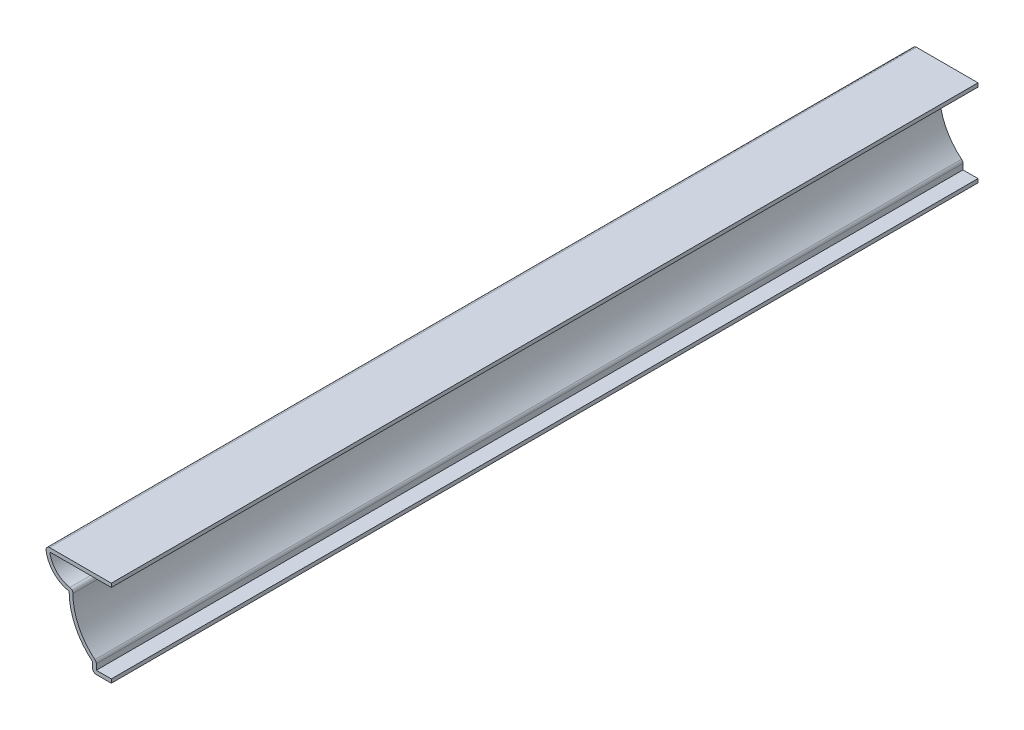
ISO-10303-21;
HEADER;
FILE_DESCRIPTION(('STEP AP214'),'2;1');
FILE_NAME('part.step','',(''),(''),'','','');
FILE_SCHEMA(('AUTOMOTIVE_DESIGN { 1 0 10303 214 1 1 1 1 }'));
ENDSEC;
DATA;
#1=APPLICATION_CONTEXT('core data for automotive mechanical design processes');
#2=APPLICATION_PROTOCOL_DEFINITION('international standard','automotive_design',2000,#1);
#3=PRODUCT_CONTEXT('',#1,'mechanical');
#4=PRODUCT('Part','Part','',(#3));
#5=PRODUCT_RELATED_PRODUCT_CATEGORY('part','',(#4));
#6=PRODUCT_DEFINITION_FORMATION('','',#4);
#7=PRODUCT_DEFINITION_CONTEXT('part definition',#1,'design');
#8=PRODUCT_DEFINITION('design','',#6,#7);
#9=PRODUCT_DEFINITION_SHAPE('','',#8);
#10=(LENGTH_UNIT() NAMED_UNIT(*) SI_UNIT(.MILLI.,.METRE.));
#11=(NAMED_UNIT(*) PLANE_ANGLE_UNIT() SI_UNIT($,.RADIAN.));
#12=(NAMED_UNIT(*) SI_UNIT($,.STERADIAN.) SOLID_ANGLE_UNIT());
#13=UNCERTAINTY_MEASURE_WITH_UNIT(LENGTH_MEASURE(1.E-05),#10,'distance_accuracy_value','');
#14=(GEOMETRIC_REPRESENTATION_CONTEXT(3) GLOBAL_UNCERTAINTY_ASSIGNED_CONTEXT((#13)) GLOBAL_UNIT_ASSIGNED_CONTEXT((#10,
#11,#12)) REPRESENTATION_CONTEXT('',''));
#15=CARTESIAN_POINT('',(0.,0.,0.));
#16=DIRECTION('',(0.,0.,1.));
#17=DIRECTION('',(1.,0.,0.));
#18=AXIS2_PLACEMENT_3D('',#15,#16,#17);
#19=CARTESIAN_POINT('',(-22.225,28.09875,-293.6875));
#20=DIRECTION('',(0.,-1.,0.));
#21=DIRECTION('',(0.,0.,-1.));
#22=AXIS2_PLACEMENT_3D('',#19,#20,#21);
#23=PLANE('',#22);
#24=DIRECTION('',(1.,0.,0.));
#25=VECTOR('',#24,1.);
#26=CARTESIAN_POINT('',(-22.225,28.09875,0.));
#27=LINE('',#26,#25);
#28=CARTESIAN_POINT('',(-20.8585986798679,28.09875,0.));
#29=VERTEX_POINT('',#28);
#30=CARTESIAN_POINT('',(0.,28.09875,0.));
#31=VERTEX_POINT('',#30);
#32=EDGE_CURVE('E203',#29,#31,#27,.T.);
#33=ORIENTED_EDGE('',*,*,#32,.F.);
#34=DIRECTION('',(0.,0.,1.));
#35=VECTOR('',#34,1.);
#36=CARTESIAN_POINT('',(-20.8585986798679,28.09875,-293.6875));
#37=LINE('',#36,#35);
#38=CARTESIAN_POINT('',(-20.8585986798679,28.09875,-293.6875));
#39=VERTEX_POINT('',#38);
#40=EDGE_CURVE('E176',#39,#29,#37,.T.);
#41=ORIENTED_EDGE('',*,*,#40,.F.);
#42=DIRECTION('',(1.,0.,0.));
#43=VECTOR('',#42,1.);
#44=CARTESIAN_POINT('',(-22.225,28.09875,-293.6875));
#45=LINE('',#44,#43);
#46=CARTESIAN_POINT('',(0.,28.09875,-293.6875));
#47=VERTEX_POINT('',#46);
#48=EDGE_CURVE('E157',#39,#47,#45,.T.);
#49=ORIENTED_EDGE('',*,*,#48,.T.);
#50=DIRECTION('',(0.,0.,1.));
#51=VECTOR('',#50,1.);
#52=CARTESIAN_POINT('',(0.,28.09875,-293.6875));
#53=LINE('',#52,#51);
#54=EDGE_CURVE('E164',#47,#31,#53,.T.);
#55=ORIENTED_EDGE('',*,*,#54,.T.);
#56=EDGE_LOOP('',(#33,#41,#49,#55));
#57=FACE_BOUND('',#56,.T.);
#58=ADVANCED_FACE('F39',(#57),#23,.T.);
#59=CARTESIAN_POINT('',(-12.54125,29.36875,-293.6875));
#60=DIRECTION('',(0.,0.,1.));
#61=DIRECTION('',(1.,0.,0.));
#62=AXIS2_PLACEMENT_3D('',#59,#60,#61);
#63=CYLINDRICAL_SURFACE('',#62,8.41375);
#64=CARTESIAN_POINT('',(-12.54125,29.36875,0.));
#65=DIRECTION('',(0.,0.,1.));
#66=DIRECTION('',(1.,0.,0.));
#67=AXIS2_PLACEMENT_3D('',#64,#65,#66);
#68=CIRCLE('',#67,8.41375);
#69=CARTESIAN_POINT('',(-14.0584836065574,21.0929303278688,0.));
#70=VERTEX_POINT('',#69);
#71=EDGE_CURVE('E177',#70,#29,#68,.F.);
#72=ORIENTED_EDGE('',*,*,#71,.F.);
#73=DIRECTION('',(0.,0.,1.));
#74=VECTOR('',#73,1.);
#75=CARTESIAN_POINT('',(-14.0584836065574,21.0929303278688,-293.6875));
#76=LINE('',#75,#74);
#77=CARTESIAN_POINT('',(-14.0584836065574,21.0929303278688,-293.6875));
#78=VERTEX_POINT('',#77);
#79=EDGE_CURVE('E270',#70,#78,#76,.F.);
#80=ORIENTED_EDGE('',*,*,#79,.T.);
#81=CARTESIAN_POINT('',(-12.54125,29.36875,-293.6875));
#82=DIRECTION('',(0.,0.,1.));
#83=DIRECTION('',(1.,0.,0.));
#84=AXIS2_PLACEMENT_3D('',#81,#82,#83);
#85=CIRCLE('',#84,8.41375);
#86=EDGE_CURVE('E172',#78,#39,#85,.F.);
#87=ORIENTED_EDGE('',*,*,#86,.T.);
#88=ORIENTED_EDGE('',*,*,#40,.T.);
#89=EDGE_LOOP('',(#72,#80,#87,#88));
#90=FACE_BOUND('',#89,.T.);
#91=ADVANCED_FACE('F284',(#90),#63,.F.);
#92=CARTESIAN_POINT('',(7.18343750000002,19.84375,-293.6875));
#93=DIRECTION('',(0.,0.,1.));
#94=DIRECTION('',(1.,0.,0.));
#95=AXIS2_PLACEMENT_3D('',#92,#93,#94);
#96=CYLINDRICAL_SURFACE('',#95,20.2009375);
#97=CARTESIAN_POINT('',(7.18343750000002,19.84375,0.));
#98=DIRECTION('',(0.,0.,1.));
#99=DIRECTION('',(1.,0.,0.));
#100=AXIS2_PLACEMENT_3D('',#97,#98,#99);
#101=CIRCLE('',#100,20.2009375);
#102=CARTESIAN_POINT('',(-5.54950092421442,4.16095194085027,0.));
#103=VERTEX_POINT('',#102);
#104=CARTESIAN_POINT('',(-13.0175,19.84375,0.));
#105=VERTEX_POINT('',#104);
#106=EDGE_CURVE('E179',#103,#105,#101,.F.);
#107=ORIENTED_EDGE('',*,*,#106,.F.);
#108=DIRECTION('',(0.,0.,1.));
#109=VECTOR('',#108,1.);
#110=CARTESIAN_POINT('',(-5.54950092421442,4.16095194085027,-293.6875));
#111=LINE('',#110,#109);
#112=CARTESIAN_POINT('',(-5.54950092421442,4.16095194085027,-293.6875));
#113=VERTEX_POINT('',#112);
#114=EDGE_CURVE('E268',#103,#113,#111,.F.);
#115=ORIENTED_EDGE('',*,*,#114,.T.);
#116=CARTESIAN_POINT('',(7.18343750000002,19.84375,-293.6875));
#117=DIRECTION('',(0.,0.,1.));
#118=DIRECTION('',(1.,0.,0.));
#119=AXIS2_PLACEMENT_3D('',#116,#117,#118);
#120=CIRCLE('',#119,20.2009375);
#121=CARTESIAN_POINT('',(-13.0175,19.84375,-293.6875));
#122=VERTEX_POINT('',#121);
#123=EDGE_CURVE('E199',#113,#122,#120,.F.);
#124=ORIENTED_EDGE('',*,*,#123,.T.);
#125=DIRECTION('',(0.,0.,1.));
#126=VECTOR('',#125,1.);
#127=CARTESIAN_POINT('',(-13.0175,19.84375,-293.6875));
#128=LINE('',#127,#126);
#129=EDGE_CURVE('E265',#122,#105,#128,.T.);
#130=ORIENTED_EDGE('',*,*,#129,.T.);
#131=EDGE_LOOP('',(#107,#115,#124,#130));
#132=FACE_BOUND('',#131,.T.);
#133=ADVANCED_FACE('F292',(#132),#96,.F.);
#134=CARTESIAN_POINT('',(-5.08,0.,-293.6875));
#135=DIRECTION('',(1.,0.,0.));
#136=DIRECTION('',(0.,0.,-1.));
#137=AXIS2_PLACEMENT_3D('',#134,#135,#136);
#138=PLANE('',#137);
#139=DIRECTION('',(0.,1.,0.));
#140=VECTOR('',#139,1.);
#141=CARTESIAN_POINT('',(-5.08,0.,-293.6875));
#142=LINE('',#141,#140);
#143=CARTESIAN_POINT('',(-5.08,1.27,-293.6875));
#144=VERTEX_POINT('',#143);
#145=CARTESIAN_POINT('',(-5.08,3.17499999999999,-293.6875));
#146=VERTEX_POINT('',#145);
#147=EDGE_CURVE('E196',#144,#146,#142,.T.);
#148=ORIENTED_EDGE('',*,*,#147,.T.);
#149=DIRECTION('',(0.,0.,1.));
#150=VECTOR('',#149,1.);
#151=CARTESIAN_POINT('',(-5.08,3.17499999999999,-293.6875));
#152=LINE('',#151,#150);
#153=CARTESIAN_POINT('',(-5.08,3.17499999999999,0.));
#154=VERTEX_POINT('',#153);
#155=EDGE_CURVE('E262',#146,#154,#152,.T.);
#156=ORIENTED_EDGE('',*,*,#155,.T.);
#157=DIRECTION('',(0.,1.,0.));
#158=VECTOR('',#157,1.);
#159=CARTESIAN_POINT('',(-5.08,0.,0.));
#160=LINE('',#159,#158);
#161=CARTESIAN_POINT('',(-5.08,1.27,0.));
#162=VERTEX_POINT('',#161);
#163=EDGE_CURVE('E222',#162,#154,#160,.T.);
#164=ORIENTED_EDGE('',*,*,#163,.F.);
#165=DIRECTION('',(0.,0.,1.));
#166=VECTOR('',#165,1.);
#167=CARTESIAN_POINT('',(-5.08,1.27,-293.6875));
#168=LINE('',#167,#166);
#169=EDGE_CURVE('E229',#144,#162,#168,.T.);
#170=ORIENTED_EDGE('',*,*,#169,.F.);
#171=EDGE_LOOP('',(#148,#156,#164,#170));
#172=FACE_BOUND('',#171,.T.);
#173=ADVANCED_FACE('F300',(#172),#138,.T.);
#174=CARTESIAN_POINT('',(0.,1.27,-293.6875));
#175=DIRECTION('',(0.,1.,0.));
#176=DIRECTION('',(0.,0.,1.));
#177=AXIS2_PLACEMENT_3D('',#174,#175,#176);
#178=PLANE('',#177);
#179=DIRECTION('',(1.,0.,0.));
#180=VECTOR('',#179,1.);
#181=CARTESIAN_POINT('',(0.,1.27,0.));
#182=LINE('',#181,#180);
#183=CARTESIAN_POINT('',(0.,1.27,0.));
#184=VERTEX_POINT('',#183);
#185=EDGE_CURVE('E219',#184,#162,#182,.F.);
#186=ORIENTED_EDGE('',*,*,#185,.F.);
#187=DIRECTION('',(0.,0.,1.));
#188=VECTOR('',#187,1.);
#189=CARTESIAN_POINT('',(0.,1.27,-293.6875));
#190=LINE('',#189,#188);
#191=CARTESIAN_POINT('',(0.,1.27,-293.6875));
#192=VERTEX_POINT('',#191);
#193=EDGE_CURVE('E231',#192,#184,#190,.T.);
#194=ORIENTED_EDGE('',*,*,#193,.F.);
#195=DIRECTION('',(1.,0.,0.));
#196=VECTOR('',#195,1.);
#197=CARTESIAN_POINT('',(0.,1.27,-293.6875));
#198=LINE('',#197,#196);
#199=EDGE_CURVE('E193',#192,#144,#198,.F.);
#200=ORIENTED_EDGE('',*,*,#199,.T.);
#201=ORIENTED_EDGE('',*,*,#169,.T.);
#202=EDGE_LOOP('',(#186,#194,#200,#201));
#203=FACE_BOUND('',#202,.T.);
#204=ADVANCED_FACE('F305',(#203),#178,.T.);
#205=CARTESIAN_POINT('',(0.,1.27,-293.6875));
#206=DIRECTION('',(-1.,0.,0.));
#207=DIRECTION('',(0.,0.,1.));
#208=AXIS2_PLACEMENT_3D('',#205,#206,#207);
#209=PLANE('',#208);
#210=DIRECTION('',(0.,-1.,0.));
#211=VECTOR('',#210,1.);
#212=CARTESIAN_POINT('',(0.,1.27,0.));
#213=LINE('',#212,#211);
#214=CARTESIAN_POINT('',(0.,0.,0.));
#215=VERTEX_POINT('',#214);
#216=EDGE_CURVE('E217',#184,#215,#213,.T.);
#217=ORIENTED_EDGE('',*,*,#216,.T.);
#218=DIRECTION('',(0.,0.,1.));
#219=VECTOR('',#218,1.);
#220=CARTESIAN_POINT('',(0.,0.,-293.6875));
#221=LINE('',#220,#219);
#222=CARTESIAN_POINT('',(0.,0.,-293.6875));
#223=VERTEX_POINT('',#222);
#224=EDGE_CURVE('E233',#223,#215,#221,.T.);
#225=ORIENTED_EDGE('',*,*,#224,.F.);
#226=DIRECTION('',(0.,-1.,0.));
#227=VECTOR('',#226,1.);
#228=CARTESIAN_POINT('',(0.,1.27,-293.6875));
#229=LINE('',#228,#227);
#230=EDGE_CURVE('E191',#192,#223,#229,.T.);
#231=ORIENTED_EDGE('',*,*,#230,.F.);
#232=ORIENTED_EDGE('',*,*,#193,.T.);
#233=EDGE_LOOP('',(#217,#225,#231,#232));
#234=FACE_BOUND('',#233,.T.);
#235=ADVANCED_FACE('F310',(#234),#209,.F.);
#236=CARTESIAN_POINT('',(0.,0.,-293.6875));
#237=DIRECTION('',(0.,1.,0.));
#238=DIRECTION('',(0.,0.,1.));
#239=AXIS2_PLACEMENT_3D('',#236,#237,#238);
#240=PLANE('',#239);
#241=DIRECTION('',(-1.,0.,0.));
#242=VECTOR('',#241,1.);
#243=CARTESIAN_POINT('',(0.,0.,0.));
#244=LINE('',#243,#242);
#245=CARTESIAN_POINT('',(-5.08,0.,0.));
#246=VERTEX_POINT('',#245);
#247=EDGE_CURVE('E214',#215,#246,#244,.T.);
#248=ORIENTED_EDGE('',*,*,#247,.T.);
#249=DIRECTION('',(0.,0.,1.));
#250=VECTOR('',#249,1.);
#251=CARTESIAN_POINT('',(-5.08,0.,-293.6875));
#252=LINE('',#251,#250);
#253=CARTESIAN_POINT('',(-5.08,0.,-293.6875));
#254=VERTEX_POINT('',#253);
#255=EDGE_CURVE('E253',#246,#254,#252,.F.);
#256=ORIENTED_EDGE('',*,*,#255,.T.);
#257=DIRECTION('',(-1.,0.,0.));
#258=VECTOR('',#257,1.);
#259=CARTESIAN_POINT('',(0.,0.,-293.6875));
#260=LINE('',#259,#258);
#261=EDGE_CURVE('E189',#223,#254,#260,.T.);
#262=ORIENTED_EDGE('',*,*,#261,.F.);
#263=ORIENTED_EDGE('',*,*,#224,.T.);
#264=EDGE_LOOP('',(#248,#256,#262,#263));
#265=FACE_BOUND('',#264,.T.);
#266=ADVANCED_FACE('F416',(#265),#240,.F.);
#267=CARTESIAN_POINT('',(-6.35,0.,-293.6875));
#268=DIRECTION('',(1.,0.,0.));
#269=DIRECTION('',(0.,0.,-1.));
#270=AXIS2_PLACEMENT_3D('',#267,#268,#269);
#271=PLANE('',#270);
#272=DIRECTION('',(0.,1.,0.));
#273=VECTOR('',#272,1.);
#274=CARTESIAN_POINT('',(-6.35,0.,-293.6875));
#275=LINE('',#274,#273);
#276=CARTESIAN_POINT('',(-6.35,1.27,-293.6875));
#277=VERTEX_POINT('',#276);
#278=CARTESIAN_POINT('',(-6.35,3.175,-293.6875));
#279=VERTEX_POINT('',#278);
#280=EDGE_CURVE('E187',#277,#279,#275,.T.);
#281=ORIENTED_EDGE('',*,*,#280,.F.);
#282=DIRECTION('',(0.,0.,1.));
#283=VECTOR('',#282,1.);
#284=CARTESIAN_POINT('',(-6.35,1.27,-293.6875));
#285=LINE('',#284,#283);
#286=CARTESIAN_POINT('',(-6.35,1.27,0.));
#287=VERTEX_POINT('',#286);
#288=EDGE_CURVE('E228',#277,#287,#285,.T.);
#289=ORIENTED_EDGE('',*,*,#288,.T.);
#290=DIRECTION('',(0.,1.,0.));
#291=VECTOR('',#290,1.);
#292=CARTESIAN_POINT('',(-6.35,0.,0.));
#293=LINE('',#292,#291);
#294=CARTESIAN_POINT('',(-6.35,3.175,0.));
#295=VERTEX_POINT('',#294);
#296=EDGE_CURVE('E212',#287,#295,#293,.T.);
#297=ORIENTED_EDGE('',*,*,#296,.T.);
#298=DIRECTION('',(0.,0.,1.));
#299=VECTOR('',#298,1.);
#300=CARTESIAN_POINT('',(-6.35,3.175,-293.6875));
#301=LINE('',#300,#299);
#302=EDGE_CURVE('E236',#279,#295,#301,.T.);
#303=ORIENTED_EDGE('',*,*,#302,.F.);
#304=EDGE_LOOP('',(#281,#289,#297,#303));
#305=FACE_BOUND('',#304,.T.);
#306=ADVANCED_FACE('F320',(#305),#271,.F.);
#307=CARTESIAN_POINT('',(7.18343750000002,19.84375,-293.6875));
#308=DIRECTION('',(0.,0.,1.));
#309=DIRECTION('',(1.,0.,0.));
#310=AXIS2_PLACEMENT_3D('',#307,#308,#309);
#311=CYLINDRICAL_SURFACE('',#310,21.4709375);
#312=CARTESIAN_POINT('',(7.18343750000002,19.84375,0.));
#313=DIRECTION('',(0.,0.,-1.));
#314=DIRECTION('',(-1.,0.,0.));
#315=AXIS2_PLACEMENT_3D('',#312,#313,#314);
#316=CIRCLE('',#315,21.4709375);
#317=CARTESIAN_POINT('',(-14.2875,19.84375,0.));
#318=VERTEX_POINT('',#317);
#319=EDGE_CURVE('E210',#295,#318,#316,.T.);
#320=ORIENTED_EDGE('',*,*,#319,.T.);
#321=DIRECTION('',(0.,0.,1.));
#322=VECTOR('',#321,1.);
#323=CARTESIAN_POINT('',(-14.2875,19.84375,-293.6875));
#324=LINE('',#323,#322);
#325=CARTESIAN_POINT('',(-14.2875,19.84375,-293.6875));
#326=VERTEX_POINT('',#325);
#327=EDGE_CURVE('E239',#326,#318,#324,.T.);
#328=ORIENTED_EDGE('',*,*,#327,.F.);
#329=CARTESIAN_POINT('',(7.18343750000002,19.84375,-293.6875));
#330=DIRECTION('',(0.,0.,-1.));
#331=DIRECTION('',(-1.,0.,0.));
#332=AXIS2_PLACEMENT_3D('',#329,#330,#331);
#333=CIRCLE('',#332,21.4709375);
#334=EDGE_CURVE('E185',#279,#326,#333,.T.);
#335=ORIENTED_EDGE('',*,*,#334,.F.);
#336=ORIENTED_EDGE('',*,*,#302,.T.);
#337=EDGE_LOOP('',(#320,#328,#335,#336));
#338=FACE_BOUND('',#337,.T.);
#339=ADVANCED_FACE('F326',(#338),#311,.T.);
#340=CARTESIAN_POINT('',(-12.54125,29.36875,-293.6875));
#341=DIRECTION('',(0.,0.,1.));
#342=DIRECTION('',(1.,0.,0.));
#343=AXIS2_PLACEMENT_3D('',#340,#341,#342);
#344=CYLINDRICAL_SURFACE('',#343,9.68375);
#345=CARTESIAN_POINT('',(-12.54125,29.36875,0.));
#346=DIRECTION('',(0.,0.,-1.));
#347=DIRECTION('',(-1.,0.,0.));
#348=AXIS2_PLACEMENT_3D('',#345,#346,#347);
#349=CIRCLE('',#348,9.68375);
#350=CARTESIAN_POINT('',(-22.1140475372064,27.9070518867924,0.));
#351=VERTEX_POINT('',#350);
#352=EDGE_CURVE('E208',#318,#351,#349,.T.);
#353=ORIENTED_EDGE('',*,*,#352,.T.);
#354=DIRECTION('',(0.,0.,1.));
#355=VECTOR('',#354,1.);
#356=CARTESIAN_POINT('',(-22.1140475372064,27.9070518867924,-293.6875));
#357=LINE('',#356,#355);
#358=CARTESIAN_POINT('',(-22.1140475372064,27.9070518867924,-293.6875));
#359=VERTEX_POINT('',#358);
#360=EDGE_CURVE('E11',#351,#359,#357,.F.);
#361=ORIENTED_EDGE('',*,*,#360,.T.);
#362=CARTESIAN_POINT('',(-12.54125,29.36875,-293.6875));
#363=DIRECTION('',(0.,0.,-1.));
#364=DIRECTION('',(-1.,0.,0.));
#365=AXIS2_PLACEMENT_3D('',#362,#363,#364);
#366=CIRCLE('',#365,9.68375);
#367=EDGE_CURVE('E183',#326,#359,#366,.T.);
#368=ORIENTED_EDGE('',*,*,#367,.F.);
#369=ORIENTED_EDGE('',*,*,#327,.T.);
#370=EDGE_LOOP('',(#353,#361,#368,#369));
#371=FACE_BOUND('',#370,.T.);
#372=ADVANCED_FACE('F328',(#371),#344,.T.);
#373=CARTESIAN_POINT('',(-22.225,29.36875,-293.6875));
#374=DIRECTION('',(0.,-1.,0.));
#375=DIRECTION('',(0.,0.,-1.));
#376=AXIS2_PLACEMENT_3D('',#373,#374,#375);
#377=PLANE('',#376);
#378=DIRECTION('',(1.,0.,0.));
#379=VECTOR('',#378,1.);
#380=CARTESIAN_POINT('',(-22.225,29.36875,-293.6875));
#381=LINE('',#380,#379);
#382=CARTESIAN_POINT('',(-20.8585986798679,29.36875,-293.6875));
#383=VERTEX_POINT('',#382);
#384=CARTESIAN_POINT('',(0.,29.36875,-293.6875));
#385=VERTEX_POINT('',#384);
#386=EDGE_CURVE('E158',#383,#385,#381,.T.);
#387=ORIENTED_EDGE('',*,*,#386,.F.);
#388=DIRECTION('',(0.,0.,1.));
#389=VECTOR('',#388,1.);
#390=CARTESIAN_POINT('',(-20.8585986798679,29.36875,-293.6875));
#391=LINE('',#390,#389);
#392=CARTESIAN_POINT('',(-20.8585986798679,29.36875,0.));
#393=VERTEX_POINT('',#392);
#394=EDGE_CURVE('E47',#383,#393,#391,.T.);
#395=ORIENTED_EDGE('',*,*,#394,.T.);
#396=DIRECTION('',(1.,0.,0.));
#397=VECTOR('',#396,1.);
#398=CARTESIAN_POINT('',(-22.225,29.36875,0.));
#399=LINE('',#398,#397);
#400=CARTESIAN_POINT('',(0.,29.36875,0.));
#401=VERTEX_POINT('',#400);
#402=EDGE_CURVE('E206',#393,#401,#399,.T.);
#403=ORIENTED_EDGE('',*,*,#402,.T.);
#404=DIRECTION('',(0.,0.,1.));
#405=VECTOR('',#404,1.);
#406=CARTESIAN_POINT('',(0.,29.36875,-293.6875));
#407=LINE('',#406,#405);
#408=EDGE_CURVE('E171',#385,#401,#407,.T.);
#409=ORIENTED_EDGE('',*,*,#408,.F.);
#410=EDGE_LOOP('',(#387,#395,#403,#409));
#411=FACE_BOUND('',#410,.T.);
#412=ADVANCED_FACE('F275',(#411),#377,.F.);
#413=CARTESIAN_POINT('',(0.,29.36875,-293.6875));
#414=DIRECTION('',(-1.,0.,0.));
#415=DIRECTION('',(0.,0.,1.));
#416=AXIS2_PLACEMENT_3D('',#413,#414,#415);
#417=PLANE('',#416);
#418=DIRECTION('',(0.,-1.,0.));
#419=VECTOR('',#418,1.);
#420=CARTESIAN_POINT('',(0.,29.36875,0.));
#421=LINE('',#420,#419);
#422=EDGE_CURVE('E167',#401,#31,#421,.T.);
#423=ORIENTED_EDGE('',*,*,#422,.T.);
#424=ORIENTED_EDGE('',*,*,#54,.F.);
#425=DIRECTION('',(0.,-1.,0.));
#426=VECTOR('',#425,1.);
#427=CARTESIAN_POINT('',(0.,29.36875,-293.6875));
#428=LINE('',#427,#426);
#429=EDGE_CURVE('E151',#385,#47,#428,.T.);
#430=ORIENTED_EDGE('',*,*,#429,.F.);
#431=ORIENTED_EDGE('',*,*,#408,.T.);
#432=EDGE_LOOP('',(#423,#424,#430,#431));
#433=FACE_BOUND('',#432,.T.);
#434=ADVANCED_FACE('F165',(#433),#417,.F.);
#435=CARTESIAN_POINT('',(-12.54125,29.36875,-293.6875));
#436=DIRECTION('',(0.,0.,-1.));
#437=DIRECTION('',(-1.,0.,0.));
#438=AXIS2_PLACEMENT_3D('',#435,#436,#437);
#439=PLANE('',#438);
#440=ORIENTED_EDGE('',*,*,#261,.T.);
#441=CARTESIAN_POINT('',(-5.08,1.27,-293.6875));
#442=DIRECTION('',(0.,0.,-1.));
#443=DIRECTION('',(-1.,0.,0.));
#444=AXIS2_PLACEMENT_3D('',#441,#442,#443);
#445=CIRCLE('',#444,1.27);
#446=EDGE_CURVE('E260',#254,#277,#445,.T.);
#447=ORIENTED_EDGE('',*,*,#446,.T.);
#448=ORIENTED_EDGE('',*,*,#280,.T.);
#449=ORIENTED_EDGE('',*,*,#334,.T.);
#450=ORIENTED_EDGE('',*,*,#367,.T.);
#451=CARTESIAN_POINT('',(-20.8585986798679,28.09875,-293.6875));
#452=DIRECTION('',(0.,0.,-1.));
#453=DIRECTION('',(-1.,0.,0.));
#454=AXIS2_PLACEMENT_3D('',#451,#452,#453);
#455=CIRCLE('',#454,1.27);
#456=EDGE_CURVE('E54',#359,#383,#455,.T.);
#457=ORIENTED_EDGE('',*,*,#456,.T.);
#458=ORIENTED_EDGE('',*,*,#386,.T.);
#459=ORIENTED_EDGE('',*,*,#429,.T.);
#460=ORIENTED_EDGE('',*,*,#48,.F.);
#461=ORIENTED_EDGE('',*,*,#86,.F.);
#462=CARTESIAN_POINT('',(-14.2875,19.84375,-293.6875));
#463=DIRECTION('',(0.,0.,-1.));
#464=DIRECTION('',(-1.,0.,0.));
#465=AXIS2_PLACEMENT_3D('',#462,#463,#464);
#466=CIRCLE('',#465,1.27);
#467=EDGE_CURVE('E256',#78,#122,#466,.T.);
#468=ORIENTED_EDGE('',*,*,#467,.T.);
#469=ORIENTED_EDGE('',*,*,#123,.F.);
#470=CARTESIAN_POINT('',(-6.35,3.17499999999999,-293.6875));
#471=DIRECTION('',(0.,0.,-1.));
#472=DIRECTION('',(-1.,0.,0.));
#473=AXIS2_PLACEMENT_3D('',#470,#471,#472);
#474=CIRCLE('',#473,1.27);
#475=EDGE_CURVE('E258',#113,#146,#474,.T.);
#476=ORIENTED_EDGE('',*,*,#475,.T.);
#477=ORIENTED_EDGE('',*,*,#147,.F.);
#478=ORIENTED_EDGE('',*,*,#199,.F.);
#479=ORIENTED_EDGE('',*,*,#230,.T.);
#480=EDGE_LOOP('',(#440,#447,#448,#449,#450,#457,#458,#459,#460,#461,#468,#469,#476,#477,#478,#479));
#481=FACE_BOUND('',#480,.T.);
#482=ADVANCED_FACE('F154',(#481),#439,.T.);
#483=CARTESIAN_POINT('',(-12.54125,29.36875,0.));
#484=DIRECTION('',(0.,0.,-1.));
#485=DIRECTION('',(-1.,0.,0.));
#486=AXIS2_PLACEMENT_3D('',#483,#484,#485);
#487=PLANE('',#486);
#488=ORIENTED_EDGE('',*,*,#296,.F.);
#489=CARTESIAN_POINT('',(-5.08,1.27,0.));
#490=DIRECTION('',(0.,0.,-1.));
#491=DIRECTION('',(-1.,0.,0.));
#492=AXIS2_PLACEMENT_3D('',#489,#490,#491);
#493=CIRCLE('',#492,1.27);
#494=EDGE_CURVE('E251',#287,#246,#493,.F.);
#495=ORIENTED_EDGE('',*,*,#494,.T.);
#496=ORIENTED_EDGE('',*,*,#247,.F.);
#497=ORIENTED_EDGE('',*,*,#216,.F.);
#498=ORIENTED_EDGE('',*,*,#185,.T.);
#499=ORIENTED_EDGE('',*,*,#163,.T.);
#500=CARTESIAN_POINT('',(-6.35,3.17499999999999,0.));
#501=DIRECTION('',(0.,0.,-1.));
#502=DIRECTION('',(-1.,0.,0.));
#503=AXIS2_PLACEMENT_3D('',#500,#501,#502);
#504=CIRCLE('',#503,1.27);
#505=EDGE_CURVE('E249',#154,#103,#504,.F.);
#506=ORIENTED_EDGE('',*,*,#505,.T.);
#507=ORIENTED_EDGE('',*,*,#106,.T.);
#508=CARTESIAN_POINT('',(-14.2875,19.84375,0.));
#509=DIRECTION('',(0.,0.,-1.));
#510=DIRECTION('',(-1.,0.,0.));
#511=AXIS2_PLACEMENT_3D('',#508,#509,#510);
#512=CIRCLE('',#511,1.27);
#513=EDGE_CURVE('E247',#105,#70,#512,.F.);
#514=ORIENTED_EDGE('',*,*,#513,.T.);
#515=ORIENTED_EDGE('',*,*,#71,.T.);
#516=ORIENTED_EDGE('',*,*,#32,.T.);
#517=ORIENTED_EDGE('',*,*,#422,.F.);
#518=ORIENTED_EDGE('',*,*,#402,.F.);
#519=CARTESIAN_POINT('',(-20.8585986798679,28.09875,0.));
#520=DIRECTION('',(0.,0.,-1.));
#521=DIRECTION('',(-1.,0.,0.));
#522=AXIS2_PLACEMENT_3D('',#519,#520,#521);
#523=CIRCLE('',#522,1.27);
#524=EDGE_CURVE('E245',#393,#351,#523,.F.);
#525=ORIENTED_EDGE('',*,*,#524,.T.);
#526=ORIENTED_EDGE('',*,*,#352,.F.);
#527=ORIENTED_EDGE('',*,*,#319,.F.);
#528=EDGE_LOOP('',(#488,#495,#496,#497,#498,#499,#506,#507,#514,#515,#516,#517,#518,#525,#526,#527));
#529=FACE_BOUND('',#528,.T.);
#530=ADVANCED_FACE('F279',(#529),#487,.F.);
#531=CARTESIAN_POINT('',(-5.08,1.27,-293.6875));
#532=DIRECTION('',(0.,0.,1.));
#533=DIRECTION('',(1.,0.,0.));
#534=AXIS2_PLACEMENT_3D('',#531,#532,#533);
#535=CYLINDRICAL_SURFACE('',#534,1.27);
#536=ORIENTED_EDGE('',*,*,#446,.F.);
#537=ORIENTED_EDGE('',*,*,#255,.F.);
#538=ORIENTED_EDGE('',*,*,#494,.F.);
#539=ORIENTED_EDGE('',*,*,#288,.F.);
#540=EDGE_LOOP('',(#536,#537,#538,#539));
#541=FACE_BOUND('',#540,.T.);
#542=ADVANCED_FACE('F318',(#541),#535,.T.);
#543=CARTESIAN_POINT('',(-6.35,3.17499999999999,-293.6875));
#544=DIRECTION('',(0.,0.,1.));
#545=DIRECTION('',(1.,0.,0.));
#546=AXIS2_PLACEMENT_3D('',#543,#544,#545);
#547=CYLINDRICAL_SURFACE('',#546,1.27);
#548=ORIENTED_EDGE('',*,*,#475,.F.);
#549=ORIENTED_EDGE('',*,*,#114,.F.);
#550=ORIENTED_EDGE('',*,*,#505,.F.);
#551=ORIENTED_EDGE('',*,*,#155,.F.);
#552=EDGE_LOOP('',(#548,#549,#550,#551));
#553=FACE_BOUND('',#552,.T.);
#554=ADVANCED_FACE('F298',(#553),#547,.T.);
#555=CARTESIAN_POINT('',(-14.2875,19.84375,-293.6875));
#556=DIRECTION('',(0.,0.,1.));
#557=DIRECTION('',(1.,0.,0.));
#558=AXIS2_PLACEMENT_3D('',#555,#556,#557);
#559=CYLINDRICAL_SURFACE('',#558,1.27);
#560=ORIENTED_EDGE('',*,*,#467,.F.);
#561=ORIENTED_EDGE('',*,*,#79,.F.);
#562=ORIENTED_EDGE('',*,*,#513,.F.);
#563=ORIENTED_EDGE('',*,*,#129,.F.);
#564=EDGE_LOOP('',(#560,#561,#562,#563));
#565=FACE_BOUND('',#564,.T.);
#566=ADVANCED_FACE('F289',(#565),#559,.T.);
#567=CARTESIAN_POINT('',(-20.8585986798679,28.09875,-293.6875));
#568=DIRECTION('',(0.,0.,1.));
#569=DIRECTION('',(1.,0.,0.));
#570=AXIS2_PLACEMENT_3D('',#567,#568,#569);
#571=CYLINDRICAL_SURFACE('',#570,1.27);
#572=ORIENTED_EDGE('',*,*,#456,.F.);
#573=ORIENTED_EDGE('',*,*,#360,.F.);
#574=ORIENTED_EDGE('',*,*,#524,.F.);
#575=ORIENTED_EDGE('',*,*,#394,.F.);
#576=EDGE_LOOP('',(#572,#573,#574,#575));
#577=FACE_BOUND('',#576,.T.);
#578=ADVANCED_FACE('F41',(#577),#571,.T.);
#579=CLOSED_SHELL('',(#58,#91,#133,#173,#204,#235,#266,#306,#339,#372,#412,#434,#482,#530,#542,
#554,#566,#578));
#580=MANIFOLD_SOLID_BREP('B2',#579);
#581=ADVANCED_BREP_SHAPE_REPRESENTATION('',(#18,#580),#14);
#582=SHAPE_DEFINITION_REPRESENTATION(#9,#581);
ENDSEC;
END-ISO-10303-21;
